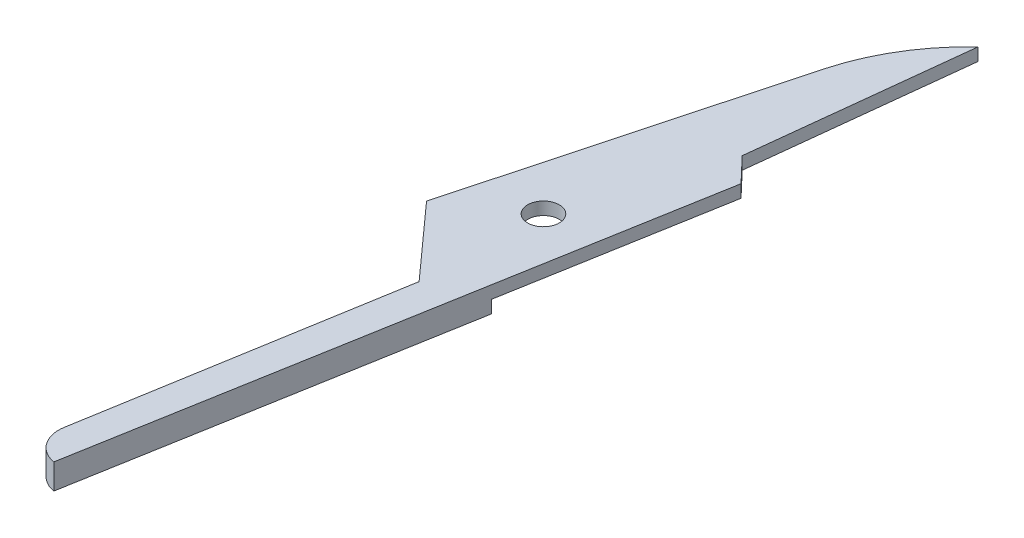
ISO-10303-21;
HEADER;
FILE_DESCRIPTION(('STEP AP214'),'2;1');
FILE_NAME('part.step','',(''),(''),'','','');
FILE_SCHEMA(('AUTOMOTIVE_DESIGN { 1 0 10303 214 1 1 1 1 }'));
ENDSEC;
DATA;
#1=APPLICATION_CONTEXT('core data for automotive mechanical design processes');
#2=APPLICATION_PROTOCOL_DEFINITION('international standard','automotive_design',2000,#1);
#3=PRODUCT_CONTEXT('',#1,'mechanical');
#4=PRODUCT('Part','Part','',(#3));
#5=PRODUCT_RELATED_PRODUCT_CATEGORY('part','',(#4));
#6=PRODUCT_DEFINITION_FORMATION('','',#4);
#7=PRODUCT_DEFINITION_CONTEXT('part definition',#1,'design');
#8=PRODUCT_DEFINITION('design','',#6,#7);
#9=PRODUCT_DEFINITION_SHAPE('','',#8);
#10=(LENGTH_UNIT() NAMED_UNIT(*) SI_UNIT(.MILLI.,.METRE.));
#11=(NAMED_UNIT(*) PLANE_ANGLE_UNIT() SI_UNIT($,.RADIAN.));
#12=(NAMED_UNIT(*) SI_UNIT($,.STERADIAN.) SOLID_ANGLE_UNIT());
#13=UNCERTAINTY_MEASURE_WITH_UNIT(LENGTH_MEASURE(1.E-05),#10,'distance_accuracy_value','');
#14=(GEOMETRIC_REPRESENTATION_CONTEXT(3) GLOBAL_UNCERTAINTY_ASSIGNED_CONTEXT((#13)) GLOBAL_UNIT_ASSIGNED_CONTEXT((#10,
#11,#12)) REPRESENTATION_CONTEXT('',''));
#15=CARTESIAN_POINT('',(0.,0.,0.));
#16=DIRECTION('',(0.,0.,1.));
#17=DIRECTION('',(1.,0.,0.));
#18=AXIS2_PLACEMENT_3D('',#15,#16,#17);
#19=CARTESIAN_POINT('',(-1.5,1.6,-38.5737652511471));
#20=DIRECTION('',(-0.723867752277045,0.,0.689938748885276));
#21=DIRECTION('',(0.689938748885276,0.,0.723867752277045));
#22=AXIS2_PLACEMENT_3D('',#19,#20,#21);
#23=PLANE('',#22);
#24=DIRECTION('',(0.689938748885276,0.,0.723867752277045));
#25=VECTOR('',#24,1.);
#26=CARTESIAN_POINT('',(-1.5,0.8,-38.5737652511471));
#27=LINE('',#26,#25);
#28=CARTESIAN_POINT('',(-1.5,0.8,-38.5737652511471));
#29=VERTEX_POINT('',#28);
#30=CARTESIAN_POINT('',(0.,0.8,-37.));
#31=VERTEX_POINT('',#30);
#32=EDGE_CURVE('E177',#29,#31,#27,.T.);
#33=ORIENTED_EDGE('',*,*,#32,.F.);
#34=DIRECTION('',(0.,-1.,0.));
#35=VECTOR('',#34,1.);
#36=CARTESIAN_POINT('',(-1.5,1.6,-38.5737652511471));
#37=LINE('',#36,#35);
#38=CARTESIAN_POINT('',(-1.5,1.6,-38.5737652511471));
#39=VERTEX_POINT('',#38);
#40=EDGE_CURVE('E165',#39,#29,#37,.T.);
#41=ORIENTED_EDGE('',*,*,#40,.F.);
#42=DIRECTION('',(-0.689938748885276,0.,-0.723867752277045));
#43=VECTOR('',#42,1.);
#44=CARTESIAN_POINT('',(-1.5,1.6,-38.5737652511471));
#45=LINE('',#44,#43);
#46=CARTESIAN_POINT('',(0.,1.6,-37.));
#47=VERTEX_POINT('',#46);
#48=EDGE_CURVE('E178',#47,#39,#45,.T.);
#49=ORIENTED_EDGE('',*,*,#48,.F.);
#50=DIRECTION('',(0.,-1.,0.));
#51=VECTOR('',#50,1.);
#52=CARTESIAN_POINT('',(0.,1.6,-37.));
#53=LINE('',#52,#51);
#54=EDGE_CURVE('E49',#47,#31,#53,.T.);
#55=ORIENTED_EDGE('',*,*,#54,.T.);
#56=EDGE_LOOP('',(#33,#41,#49,#55));
#57=FACE_BOUND('',#56,.T.);
#58=ADVANCED_FACE('F39',(#57),#23,.F.);
#59=CARTESIAN_POINT('',(0.,1.6,-52.));
#60=DIRECTION('',(-0.993816966891354,0.,-0.111030789958771));
#61=DIRECTION('',(-0.111030789958771,0.,0.993816966891355));
#62=AXIS2_PLACEMENT_3D('',#59,#60,#61);
#63=PLANE('',#62);
#64=DIRECTION('',(-0.111030789958771,0.,0.993816966891355));
#65=VECTOR('',#64,1.);
#66=CARTESIAN_POINT('',(0.,0.8,-52.));
#67=LINE('',#66,#65);
#68=CARTESIAN_POINT('',(0.,0.8,-52.));
#69=VERTEX_POINT('',#68);
#70=EDGE_CURVE('E191',#69,#29,#67,.T.);
#71=ORIENTED_EDGE('',*,*,#70,.F.);
#72=DIRECTION('',(0.,-1.,0.));
#73=VECTOR('',#72,1.);
#74=CARTESIAN_POINT('',(0.,1.6,-52.));
#75=LINE('',#74,#73);
#76=CARTESIAN_POINT('',(0.,1.6,-52.));
#77=VERTEX_POINT('',#76);
#78=EDGE_CURVE('E161',#77,#69,#75,.T.);
#79=ORIENTED_EDGE('',*,*,#78,.F.);
#80=DIRECTION('',(0.111030789958771,0.,-0.993816966891354));
#81=VECTOR('',#80,1.);
#82=CARTESIAN_POINT('',(0.,1.6,-52.));
#83=LINE('',#82,#81);
#84=EDGE_CURVE('E204',#39,#77,#83,.T.);
#85=ORIENTED_EDGE('',*,*,#84,.F.);
#86=ORIENTED_EDGE('',*,*,#40,.T.);
#87=EDGE_LOOP('',(#71,#79,#85,#86));
#88=FACE_BOUND('',#87,.T.);
#89=ADVANCED_FACE('F211',(#88),#63,.F.);
#90=CARTESIAN_POINT('',(8.83303886276608,1.6,-42.5261107478803));
#91=DIRECTION('',(0.,-1.,0.));
#92=DIRECTION('',(0.,0.,-1.));
#93=AXIS2_PLACEMENT_3D('',#90,#91,#92);
#94=CYLINDRICAL_SURFACE('',#93,12.9528820388578);
#95=CARTESIAN_POINT('',(8.83303886276608,0.8,-42.5261107478803));
#96=DIRECTION('',(0.,-1.,0.));
#97=DIRECTION('',(0.,0.,-1.));
#98=AXIS2_PLACEMENT_3D('',#95,#96,#97);
#99=CIRCLE('',#98,12.9528820388578);
#100=CARTESIAN_POINT('',(-3.67527211848781,0.8,-45.8905289009654));
#101=VERTEX_POINT('',#100);
#102=EDGE_CURVE('E219',#101,#69,#99,.T.);
#103=ORIENTED_EDGE('',*,*,#102,.F.);
#104=DIRECTION('',(0.,-1.,0.));
#105=VECTOR('',#104,1.);
#106=CARTESIAN_POINT('',(-3.67527211848781,1.6,-45.8905289009654));
#107=LINE('',#106,#105);
#108=CARTESIAN_POINT('',(-3.67527211848781,1.6,-45.8905289009654));
#109=VERTEX_POINT('',#108);
#110=EDGE_CURVE('E129',#109,#101,#107,.T.);
#111=ORIENTED_EDGE('',*,*,#110,.F.);
#112=CARTESIAN_POINT('',(8.83303886276608,1.6,-42.5261107478803));
#113=DIRECTION('',(0.,1.,0.));
#114=DIRECTION('',(0.,0.,-1.));
#115=AXIS2_PLACEMENT_3D('',#112,#113,#114);
#116=CIRCLE('',#115,12.9528820388578);
#117=EDGE_CURVE('E113',#77,#109,#116,.T.);
#118=ORIENTED_EDGE('',*,*,#117,.F.);
#119=ORIENTED_EDGE('',*,*,#78,.T.);
#120=EDGE_LOOP('',(#103,#111,#118,#119));
#121=FACE_BOUND('',#120,.T.);
#122=ADVANCED_FACE('F216',(#121),#94,.T.);
#123=CARTESIAN_POINT('',(-9.,1.6,-26.0941334465437));
#124=DIRECTION('',(0.965677827044959,0.,0.2597428234884));
#125=DIRECTION('',(0.2597428234884,0.,-0.965677827044959));
#126=AXIS2_PLACEMENT_3D('',#123,#124,#125);
#127=PLANE('',#126);
#128=DIRECTION('',(0.2597428234884,0.,-0.965677827044959));
#129=VECTOR('',#128,1.);
#130=CARTESIAN_POINT('',(-9.,0.8,-26.0941334465437));
#131=LINE('',#130,#129);
#132=CARTESIAN_POINT('',(-9.,0.8,-26.0941334465437));
#133=VERTEX_POINT('',#132);
#134=EDGE_CURVE('E125',#133,#101,#131,.T.);
#135=ORIENTED_EDGE('',*,*,#134,.F.);
#136=DIRECTION('',(0.,-1.,0.));
#137=VECTOR('',#136,1.);
#138=CARTESIAN_POINT('',(-9.,1.6,-26.0941334465437));
#139=LINE('',#138,#137);
#140=CARTESIAN_POINT('',(-9.,1.6,-26.0941334465437));
#141=VERTEX_POINT('',#140);
#142=EDGE_CURVE('E121',#141,#133,#139,.T.);
#143=ORIENTED_EDGE('',*,*,#142,.F.);
#144=DIRECTION('',(-0.2597428234884,0.,0.965677827044959));
#145=VECTOR('',#144,1.);
#146=CARTESIAN_POINT('',(-9.,1.6,-26.0941334465437));
#147=LINE('',#146,#145);
#148=EDGE_CURVE('E106',#109,#141,#147,.T.);
#149=ORIENTED_EDGE('',*,*,#148,.F.);
#150=ORIENTED_EDGE('',*,*,#110,.T.);
#151=EDGE_LOOP('',(#135,#143,#149,#150));
#152=FACE_BOUND('',#151,.T.);
#153=ADVANCED_FACE('F122',(#152),#127,.F.);
#154=CARTESIAN_POINT('',(-4.6,0.,-29.0941334465437));
#155=DIRECTION('',(0.,1.,0.));
#156=DIRECTION('',(0.,0.,1.));
#157=AXIS2_PLACEMENT_3D('',#154,#155,#156);
#158=CYLINDRICAL_SURFACE('',#157,1.);
#159=CARTESIAN_POINT('',(-4.6,1.6,-29.0941334465437));
#160=DIRECTION('',(0.,1.,0.));
#161=DIRECTION('',(0.,0.,1.));
#162=AXIS2_PLACEMENT_3D('',#159,#160,#161);
#163=CIRCLE('',#162,1.);
#164=CARTESIAN_POINT('',(-4.6,1.6,-28.0941334465437));
#165=VERTEX_POINT('',#164);
#166=EDGE_CURVE('E145',#165,#165,#163,.T.);
#167=ORIENTED_EDGE('',*,*,#166,.T.);
#168=EDGE_LOOP('',(#167));
#169=FACE_BOUND('',#168,.T.);
#170=CARTESIAN_POINT('',(-4.6,0.8,-29.0941334465437));
#171=DIRECTION('',(0.,-1.,0.));
#172=DIRECTION('',(0.,0.,-1.));
#173=AXIS2_PLACEMENT_3D('',#170,#171,#172);
#174=CIRCLE('',#173,1.);
#175=CARTESIAN_POINT('',(-4.6,0.8,-30.0941334465437));
#176=VERTEX_POINT('',#175);
#177=EDGE_CURVE('E43',#176,#176,#174,.F.);
#178=ORIENTED_EDGE('',*,*,#177,.F.);
#179=EDGE_LOOP('',(#178));
#180=FACE_BOUND('',#179,.T.);
#181=ADVANCED_FACE('F279',(#169,#180),#158,.F.);
#182=CARTESIAN_POINT('',(-6.16678069336493,1.6,-1.89678682238425));
#183=DIRECTION('',(0.,-1.,0.));
#184=DIRECTION('',(0.,0.,-1.));
#185=AXIS2_PLACEMENT_3D('',#182,#183,#184);
#186=CYLINDRICAL_SURFACE('',#185,1.92583367814692);
#187=CARTESIAN_POINT('',(-6.16678069336493,0.,-1.89678682238425));
#188=DIRECTION('',(0.,1.,0.));
#189=DIRECTION('',(0.,0.,-1.));
#190=AXIS2_PLACEMENT_3D('',#187,#188,#189);
#191=CIRCLE('',#190,1.92583367814692);
#192=CARTESIAN_POINT('',(-8.06578820395637,0.,-2.21710827124804));
#193=VERTEX_POINT('',#192);
#194=CARTESIAN_POINT('',(-6.5,0.,0.));
#195=VERTEX_POINT('',#194);
#196=EDGE_CURVE('E140',#193,#195,#191,.T.);
#197=ORIENTED_EDGE('',*,*,#196,.T.);
#198=DIRECTION('',(0.,-1.,0.));
#199=VECTOR('',#198,1.);
#200=CARTESIAN_POINT('',(-6.5,1.6,0.));
#201=LINE('',#200,#199);
#202=CARTESIAN_POINT('',(-6.5,1.6,0.));
#203=VERTEX_POINT('',#202);
#204=EDGE_CURVE('E11',#203,#195,#201,.T.);
#205=ORIENTED_EDGE('',*,*,#204,.F.);
#206=CARTESIAN_POINT('',(-6.16678069336493,1.6,-1.89678682238425));
#207=DIRECTION('',(0.,1.,0.));
#208=DIRECTION('',(0.,0.,-1.));
#209=AXIS2_PLACEMENT_3D('',#206,#207,#208);
#210=CIRCLE('',#209,1.92583367814692);
#211=CARTESIAN_POINT('',(-8.06578820395637,1.6,-2.21710827124804));
#212=VERTEX_POINT('',#211);
#213=EDGE_CURVE('E154',#212,#203,#210,.T.);
#214=ORIENTED_EDGE('',*,*,#213,.F.);
#215=DIRECTION('',(0.,-1.,0.));
#216=VECTOR('',#215,1.);
#217=CARTESIAN_POINT('',(-8.06578820395637,1.6,-2.21710827124804));
#218=LINE('',#217,#216);
#219=EDGE_CURVE('E136',#212,#193,#218,.T.);
#220=ORIENTED_EDGE('',*,*,#219,.T.);
#221=EDGE_LOOP('',(#197,#205,#214,#220));
#222=FACE_BOUND('',#221,.T.);
#223=ADVANCED_FACE('F41',(#222),#186,.T.);
#224=CARTESIAN_POINT('',(0.,1.6,-37.));
#225=DIRECTION('',(-0.984917256307087,0.,-0.17302600448638));
#226=DIRECTION('',(-0.17302600448638,0.,0.984917256307087));
#227=AXIS2_PLACEMENT_3D('',#224,#225,#226);
#228=PLANE('',#227);
#229=DIRECTION('',(0.17302600448638,0.,-0.984917256307087));
#230=VECTOR('',#229,1.);
#231=CARTESIAN_POINT('',(0.,0.,-37.));
#232=LINE('',#231,#230);
#233=CARTESIAN_POINT('',(-2.35914773595657,0.,-23.5710051953242));
#234=VERTEX_POINT('',#233);
#235=EDGE_CURVE('E144',#195,#234,#232,.T.);
#236=ORIENTED_EDGE('',*,*,#235,.T.);
#237=DIRECTION('',(0.,1.,0.));
#238=VECTOR('',#237,1.);
#239=CARTESIAN_POINT('',(-2.35914773595657,1.6,-23.5710051953242));
#240=LINE('',#239,#238);
#241=CARTESIAN_POINT('',(-2.35914773595657,0.8,-23.5710051953242));
#242=VERTEX_POINT('',#241);
#243=EDGE_CURVE('E56',#234,#242,#240,.T.);
#244=ORIENTED_EDGE('',*,*,#243,.T.);
#245=DIRECTION('',(-0.17302600448638,0.,0.984917256307087));
#246=VECTOR('',#245,1.);
#247=CARTESIAN_POINT('',(0.,0.8,-37.));
#248=LINE('',#247,#246);
#249=EDGE_CURVE('E182',#31,#242,#248,.T.);
#250=ORIENTED_EDGE('',*,*,#249,.F.);
#251=ORIENTED_EDGE('',*,*,#54,.F.);
#252=DIRECTION('',(0.17302600448638,0.,-0.984917256307087));
#253=VECTOR('',#252,1.);
#254=CARTESIAN_POINT('',(0.,1.6,-37.));
#255=LINE('',#254,#253);
#256=EDGE_CURVE('E91',#203,#47,#255,.T.);
#257=ORIENTED_EDGE('',*,*,#256,.F.);
#258=ORIENTED_EDGE('',*,*,#204,.T.);
#259=EDGE_LOOP('',(#236,#244,#250,#251,#257,#258));
#260=FACE_BOUND('',#259,.T.);
#261=ADVANCED_FACE('F180',(#260),#228,.F.);
#262=CARTESIAN_POINT('',(-9.,1.6,-26.0941334465437));
#263=DIRECTION('',(0.743784501151942,0.,-0.668419490923295));
#264=DIRECTION('',(-0.668419490923295,0.,-0.743784501151942));
#265=AXIS2_PLACEMENT_3D('',#262,#263,#264);
#266=PLANE('',#265);
#267=DIRECTION('',(-0.668419490923295,0.,-0.743784501151942));
#268=VECTOR('',#267,1.);
#269=CARTESIAN_POINT('',(-9.,0.8,-26.0941334465437));
#270=LINE('',#269,#268);
#271=CARTESIAN_POINT('',(-5.44103893530801,0.8,-22.1338957274661));
#272=VERTEX_POINT('',#271);
#273=EDGE_CURVE('E232',#272,#133,#270,.T.);
#274=ORIENTED_EDGE('',*,*,#273,.F.);
#275=DIRECTION('',(0.,-1.,0.));
#276=VECTOR('',#275,1.);
#277=CARTESIAN_POINT('',(-5.44103893530801,0.8,-22.1338957274661));
#278=LINE('',#277,#276);
#279=CARTESIAN_POINT('',(-5.44103893530801,0.,-22.1338957274661));
#280=VERTEX_POINT('',#279);
#281=EDGE_CURVE('E235',#272,#280,#278,.T.);
#282=ORIENTED_EDGE('',*,*,#281,.T.);
#283=DIRECTION('',(0.668419490923295,0.,0.743784501151942));
#284=VECTOR('',#283,1.);
#285=CARTESIAN_POINT('',(-9.,0.,-26.0941334465437));
#286=LINE('',#285,#284);
#287=CARTESIAN_POINT('',(-4.82237818172941,0.,-21.4454803143441));
#288=VERTEX_POINT('',#287);
#289=EDGE_CURVE('E149',#280,#288,#286,.T.);
#290=ORIENTED_EDGE('',*,*,#289,.T.);
#291=DIRECTION('',(0.,-1.,0.));
#292=VECTOR('',#291,1.);
#293=CARTESIAN_POINT('',(-4.82237818172941,1.6,-21.4454803143441));
#294=LINE('',#293,#292);
#295=CARTESIAN_POINT('',(-4.82237818172941,1.6,-21.4454803143441));
#296=VERTEX_POINT('',#295);
#297=EDGE_CURVE('E130',#296,#288,#294,.T.);
#298=ORIENTED_EDGE('',*,*,#297,.F.);
#299=DIRECTION('',(0.668419490923295,0.,0.743784501151942));
#300=VECTOR('',#299,1.);
#301=CARTESIAN_POINT('',(-9.,1.6,-26.0941334465437));
#302=LINE('',#301,#300);
#303=EDGE_CURVE('E110',#141,#296,#302,.T.);
#304=ORIENTED_EDGE('',*,*,#303,.F.);
#305=ORIENTED_EDGE('',*,*,#142,.T.);
#306=EDGE_LOOP('',(#274,#282,#290,#298,#304,#305));
#307=FACE_BOUND('',#306,.T.);
#308=ADVANCED_FACE('F132',(#307),#266,.F.);
#309=CARTESIAN_POINT('',(-8.06578820395637,1.6,-2.21710827124804));
#310=DIRECTION('',(0.986070361184413,0.,0.166328719088562));
#311=DIRECTION('',(0.166328719088562,0.,-0.986070361184413));
#312=AXIS2_PLACEMENT_3D('',#309,#310,#311);
#313=PLANE('',#312);
#314=DIRECTION('',(-0.166328719088562,0.,0.986070361184413));
#315=VECTOR('',#314,1.);
#316=CARTESIAN_POINT('',(-8.06578820395637,0.,-2.21710827124804));
#317=LINE('',#316,#315);
#318=EDGE_CURVE('E83',#288,#193,#317,.T.);
#319=ORIENTED_EDGE('',*,*,#318,.T.);
#320=ORIENTED_EDGE('',*,*,#219,.F.);
#321=DIRECTION('',(-0.166328719088562,0.,0.986070361184413));
#322=VECTOR('',#321,1.);
#323=CARTESIAN_POINT('',(-8.06578820395637,1.6,-2.21710827124804));
#324=LINE('',#323,#322);
#325=EDGE_CURVE('E65',#296,#212,#324,.T.);
#326=ORIENTED_EDGE('',*,*,#325,.F.);
#327=ORIENTED_EDGE('',*,*,#297,.T.);
#328=EDGE_LOOP('',(#319,#320,#326,#327));
#329=FACE_BOUND('',#328,.T.);
#330=ADVANCED_FACE('F257',(#329),#313,.F.);
#331=CARTESIAN_POINT('',(-6.16678069336493,1.6,-1.89678682238425));
#332=DIRECTION('',(0.,-1.,0.));
#333=DIRECTION('',(0.,0.,-1.));
#334=AXIS2_PLACEMENT_3D('',#331,#332,#333);
#335=PLANE('',#334);
#336=ORIENTED_EDGE('',*,*,#166,.F.);
#337=EDGE_LOOP('',(#336));
#338=FACE_BOUND('',#337,.T.);
#339=ORIENTED_EDGE('',*,*,#213,.T.);
#340=ORIENTED_EDGE('',*,*,#256,.T.);
#341=ORIENTED_EDGE('',*,*,#48,.T.);
#342=ORIENTED_EDGE('',*,*,#84,.T.);
#343=ORIENTED_EDGE('',*,*,#117,.T.);
#344=ORIENTED_EDGE('',*,*,#148,.T.);
#345=ORIENTED_EDGE('',*,*,#303,.T.);
#346=ORIENTED_EDGE('',*,*,#325,.T.);
#347=EDGE_LOOP('',(#339,#340,#341,#342,#343,#344,#345,#346));
#348=FACE_BOUND('',#347,.T.);
#349=ADVANCED_FACE('F108',(#338,#348),#335,.F.);
#350=CARTESIAN_POINT('',(-6.16678069336493,0.,-1.89678682238425));
#351=DIRECTION('',(0.,-1.,0.));
#352=DIRECTION('',(0.,0.,-1.));
#353=AXIS2_PLACEMENT_3D('',#350,#351,#352);
#354=PLANE('',#353);
#355=DIRECTION('',(-0.90630778703665,0.,0.4226182617407));
#356=VECTOR('',#355,1.);
#357=CARTESIAN_POINT('',(6.62146374071269,0.,-27.7587331018097));
#358=LINE('',#357,#356);
#359=EDGE_CURVE('E240',#234,#280,#358,.T.);
#360=ORIENTED_EDGE('',*,*,#359,.F.);
#361=ORIENTED_EDGE('',*,*,#235,.F.);
#362=ORIENTED_EDGE('',*,*,#196,.F.);
#363=ORIENTED_EDGE('',*,*,#318,.F.);
#364=ORIENTED_EDGE('',*,*,#289,.F.);
#365=EDGE_LOOP('',(#360,#361,#362,#363,#364));
#366=FACE_BOUND('',#365,.T.);
#367=ADVANCED_FACE('F252',(#366),#354,.T.);
#368=CARTESIAN_POINT('',(6.62146374071269,0.8,-27.7587331018097));
#369=DIRECTION('',(0.4226182617407,0.,0.90630778703665));
#370=DIRECTION('',(0.90630778703665,0.,-0.4226182617407));
#371=AXIS2_PLACEMENT_3D('',#368,#369,#370);
#372=PLANE('',#371);
#373=ORIENTED_EDGE('',*,*,#359,.T.);
#374=ORIENTED_EDGE('',*,*,#281,.F.);
#375=DIRECTION('',(-0.90630778703665,0.,0.4226182617407));
#376=VECTOR('',#375,1.);
#377=CARTESIAN_POINT('',(6.62146374071269,0.8,-27.7587331018097));
#378=LINE('',#377,#376);
#379=EDGE_CURVE('E239',#242,#272,#378,.T.);
#380=ORIENTED_EDGE('',*,*,#379,.F.);
#381=ORIENTED_EDGE('',*,*,#243,.F.);
#382=EDGE_LOOP('',(#373,#374,#380,#381));
#383=FACE_BOUND('',#382,.T.);
#384=ADVANCED_FACE('F248',(#383),#372,.F.);
#385=CARTESIAN_POINT('',(0.,0.8,0.));
#386=DIRECTION('',(0.,-1.,0.));
#387=DIRECTION('',(0.,0.,-1.));
#388=AXIS2_PLACEMENT_3D('',#385,#386,#387);
#389=PLANE('',#388);
#390=ORIENTED_EDGE('',*,*,#177,.T.);
#391=EDGE_LOOP('',(#390));
#392=FACE_BOUND('',#391,.T.);
#393=ORIENTED_EDGE('',*,*,#249,.T.);
#394=ORIENTED_EDGE('',*,*,#379,.T.);
#395=ORIENTED_EDGE('',*,*,#273,.T.);
#396=ORIENTED_EDGE('',*,*,#134,.T.);
#397=ORIENTED_EDGE('',*,*,#102,.T.);
#398=ORIENTED_EDGE('',*,*,#70,.T.);
#399=ORIENTED_EDGE('',*,*,#32,.T.);
#400=EDGE_LOOP('',(#393,#394,#395,#396,#397,#398,#399));
#401=FACE_BOUND('',#400,.T.);
#402=ADVANCED_FACE('F225',(#392,#401),#389,.T.);
#403=CLOSED_SHELL('',(#58,#89,#122,#153,#181,#223,#261,#308,#330,#349,#367,#384,#402));
#404=MANIFOLD_SOLID_BREP('B2',#403);
#405=ADVANCED_BREP_SHAPE_REPRESENTATION('',(#18,#404),#14);
#406=SHAPE_DEFINITION_REPRESENTATION(#9,#405);
ENDSEC;
END-ISO-10303-21;
